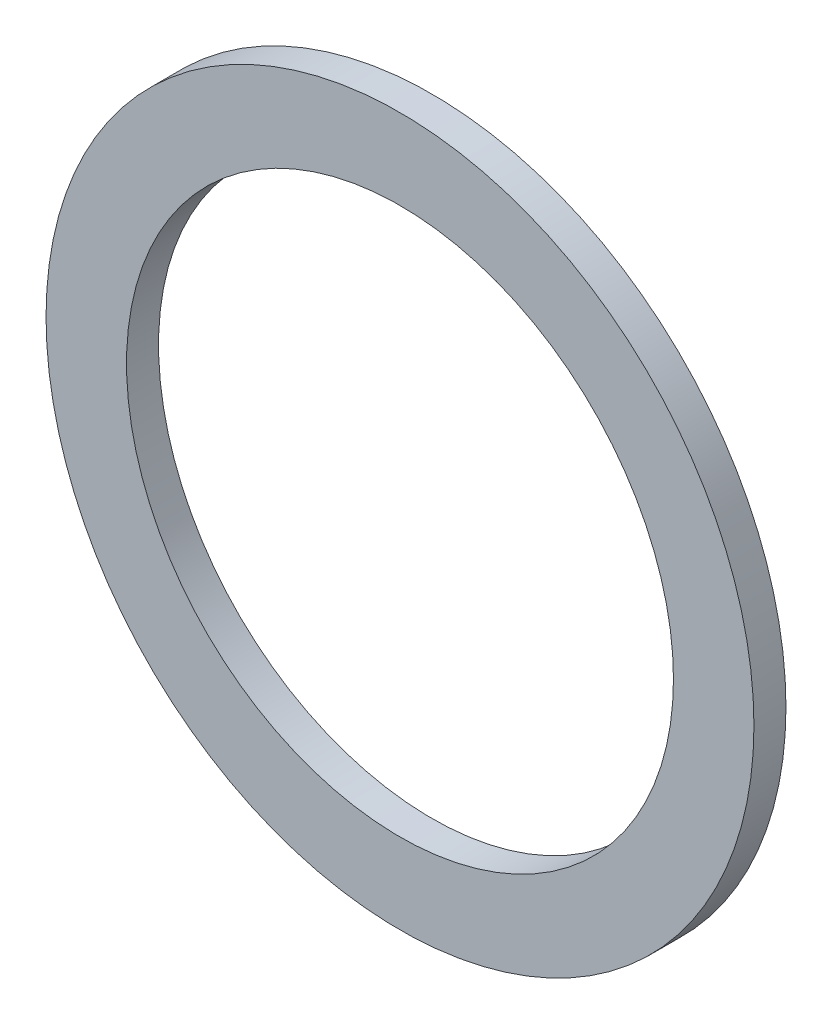
ISO-10303-21;
HEADER;
FILE_DESCRIPTION(('STEP AP214'),'2;1');
FILE_NAME('part.step','',(''),(''),'','','');
FILE_SCHEMA(('AUTOMOTIVE_DESIGN { 1 0 10303 214 1 1 1 1 }'));
ENDSEC;
DATA;
#1=APPLICATION_CONTEXT('core data for automotive mechanical design processes');
#2=APPLICATION_PROTOCOL_DEFINITION('international standard','automotive_design',2000,#1);
#3=PRODUCT_CONTEXT('',#1,'mechanical');
#4=PRODUCT('Part','Part','',(#3));
#5=PRODUCT_RELATED_PRODUCT_CATEGORY('part','',(#4));
#6=PRODUCT_DEFINITION_FORMATION('','',#4);
#7=PRODUCT_DEFINITION_CONTEXT('part definition',#1,'design');
#8=PRODUCT_DEFINITION('design','',#6,#7);
#9=PRODUCT_DEFINITION_SHAPE('','',#8);
#10=(LENGTH_UNIT() NAMED_UNIT(*) SI_UNIT(.MILLI.,.METRE.));
#11=(NAMED_UNIT(*) PLANE_ANGLE_UNIT() SI_UNIT($,.RADIAN.));
#12=(NAMED_UNIT(*) SI_UNIT($,.STERADIAN.) SOLID_ANGLE_UNIT());
#13=UNCERTAINTY_MEASURE_WITH_UNIT(LENGTH_MEASURE(1.E-05),#10,'distance_accuracy_value','');
#14=(GEOMETRIC_REPRESENTATION_CONTEXT(3) GLOBAL_UNCERTAINTY_ASSIGNED_CONTEXT((#13)) GLOBAL_UNIT_ASSIGNED_CONTEXT((#10,
#11,#12)) REPRESENTATION_CONTEXT('',''));
#15=CARTESIAN_POINT('',(0.,0.,0.));
#16=DIRECTION('',(0.,0.,1.));
#17=DIRECTION('',(1.,0.,0.));
#18=AXIS2_PLACEMENT_3D('',#15,#16,#17);
#19=CARTESIAN_POINT('',(0.,0.,1.75));
#20=DIRECTION('',(0.,0.,1.));
#21=DIRECTION('',(1.,0.,0.));
#22=AXIS2_PLACEMENT_3D('',#19,#20,#21);
#23=PLANE('',#22);
#24=CARTESIAN_POINT('',(0.,0.,1.75));
#25=DIRECTION('',(0.,0.,1.));
#26=DIRECTION('',(1.,0.,0.));
#27=AXIS2_PLACEMENT_3D('',#24,#25,#26);
#28=CIRCLE('',#27,19.35);
#29=CARTESIAN_POINT('',(19.35,0.,1.75));
#30=VERTEX_POINT('',#29);
#31=EDGE_CURVE('E10',#30,#30,#28,.T.);
#32=ORIENTED_EDGE('',*,*,#31,.T.);
#33=EDGE_LOOP('',(#32));
#34=FACE_BOUND('',#33,.T.);
#35=CARTESIAN_POINT('',(0.,0.,1.75));
#36=DIRECTION('',(0.,0.,1.));
#37=DIRECTION('',(1.,0.,0.));
#38=AXIS2_PLACEMENT_3D('',#35,#36,#37);
#39=CIRCLE('',#38,14.95);
#40=CARTESIAN_POINT('',(14.95,0.,1.75));
#41=VERTEX_POINT('',#40);
#42=EDGE_CURVE('E41',#41,#41,#39,.T.);
#43=ORIENTED_EDGE('',*,*,#42,.F.);
#44=EDGE_LOOP('',(#43));
#45=FACE_BOUND('',#44,.T.);
#46=ADVANCED_FACE('F30',(#34,#45),#23,.T.);
#47=CARTESIAN_POINT('',(0.,0.,0.));
#48=DIRECTION('',(0.,0.,1.));
#49=DIRECTION('',(1.,0.,0.));
#50=AXIS2_PLACEMENT_3D('',#47,#48,#49);
#51=PLANE('',#50);
#52=CARTESIAN_POINT('',(0.,0.,0.));
#53=DIRECTION('',(0.,0.,1.));
#54=DIRECTION('',(1.,0.,0.));
#55=AXIS2_PLACEMENT_3D('',#52,#53,#54);
#56=CIRCLE('',#55,19.35);
#57=CARTESIAN_POINT('',(19.35,0.,0.));
#58=VERTEX_POINT('',#57);
#59=EDGE_CURVE('E34',#58,#58,#56,.T.);
#60=ORIENTED_EDGE('',*,*,#59,.F.);
#61=EDGE_LOOP('',(#60));
#62=FACE_BOUND('',#61,.T.);
#63=CARTESIAN_POINT('',(0.,0.,0.));
#64=DIRECTION('',(0.,0.,1.));
#65=DIRECTION('',(1.,0.,0.));
#66=AXIS2_PLACEMENT_3D('',#63,#64,#65);
#67=CIRCLE('',#66,14.95);
#68=CARTESIAN_POINT('',(14.95,0.,0.));
#69=VERTEX_POINT('',#68);
#70=EDGE_CURVE('E43',#69,#69,#67,.T.);
#71=ORIENTED_EDGE('',*,*,#70,.T.);
#72=EDGE_LOOP('',(#71));
#73=FACE_BOUND('',#72,.T.);
#74=ADVANCED_FACE('F53',(#62,#73),#51,.F.);
#75=CARTESIAN_POINT('',(0.,0.,1.75));
#76=DIRECTION('',(0.,0.,-1.));
#77=DIRECTION('',(-1.,0.,0.));
#78=AXIS2_PLACEMENT_3D('',#75,#76,#77);
#79=CYLINDRICAL_SURFACE('',#78,19.35);
#80=ORIENTED_EDGE('',*,*,#31,.F.);
#81=EDGE_LOOP('',(#80));
#82=FACE_BOUND('',#81,.T.);
#83=ORIENTED_EDGE('',*,*,#59,.T.);
#84=EDGE_LOOP('',(#83));
#85=FACE_BOUND('',#84,.T.);
#86=ADVANCED_FACE('F32',(#82,#85),#79,.T.);
#87=CARTESIAN_POINT('',(0.,0.,1.75));
#88=DIRECTION('',(0.,0.,-1.));
#89=DIRECTION('',(-1.,0.,0.));
#90=AXIS2_PLACEMENT_3D('',#87,#88,#89);
#91=CYLINDRICAL_SURFACE('',#90,14.95);
#92=ORIENTED_EDGE('',*,*,#42,.T.);
#93=EDGE_LOOP('',(#92));
#94=FACE_BOUND('',#93,.T.);
#95=ORIENTED_EDGE('',*,*,#70,.F.);
#96=EDGE_LOOP('',(#95));
#97=FACE_BOUND('',#96,.T.);
#98=ADVANCED_FACE('F49',(#94,#97),#91,.F.);
#99=CLOSED_SHELL('',(#46,#74,#86,#98));
#100=MANIFOLD_SOLID_BREP('B2',#99);
#101=ADVANCED_BREP_SHAPE_REPRESENTATION('',(#18,#100),#14);
#102=SHAPE_DEFINITION_REPRESENTATION(#9,#101);
ENDSEC;
END-ISO-10303-21;
